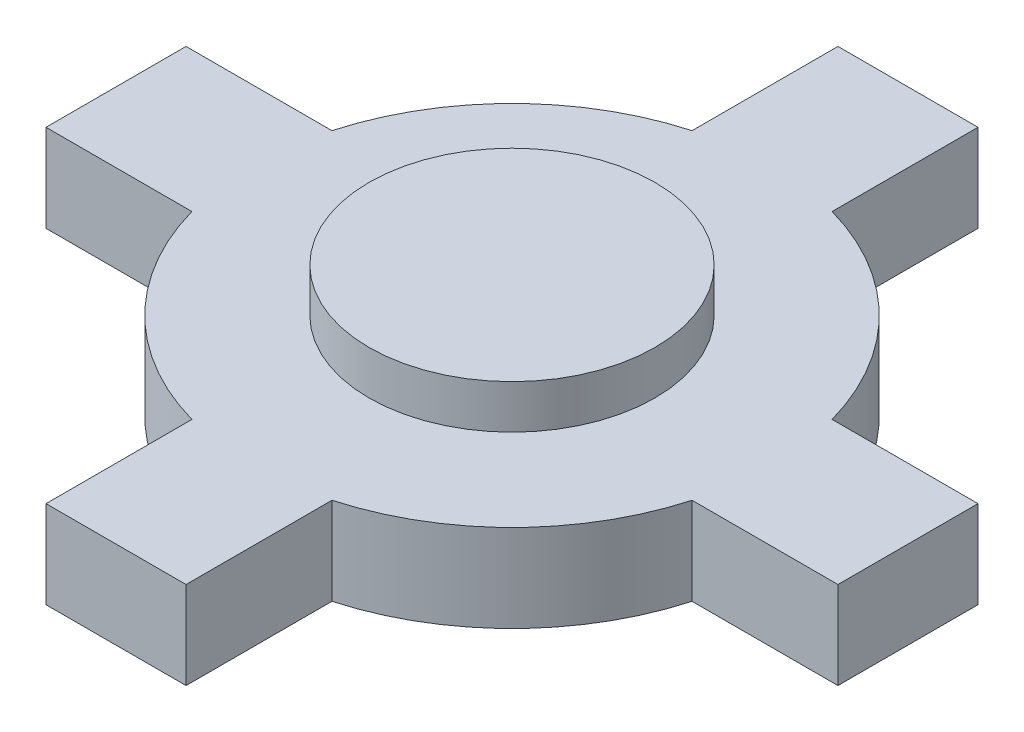
ISO-10303-21;
HEADER;
FILE_DESCRIPTION(('STEP AP214'),'2;1');
FILE_NAME('part.step','',(''),(''),'','','');
FILE_SCHEMA(('AUTOMOTIVE_DESIGN { 1 0 10303 214 1 1 1 1 }'));
ENDSEC;
DATA;
#1=APPLICATION_CONTEXT('core data for automotive mechanical design processes');
#2=APPLICATION_PROTOCOL_DEFINITION('international standard','automotive_design',2000,#1);
#3=PRODUCT_CONTEXT('',#1,'mechanical');
#4=PRODUCT('Part','Part','',(#3));
#5=PRODUCT_RELATED_PRODUCT_CATEGORY('part','',(#4));
#6=PRODUCT_DEFINITION_FORMATION('','',#4);
#7=PRODUCT_DEFINITION_CONTEXT('part definition',#1,'design');
#8=PRODUCT_DEFINITION('design','',#6,#7);
#9=PRODUCT_DEFINITION_SHAPE('','',#8);
#10=(LENGTH_UNIT() NAMED_UNIT(*) SI_UNIT(.MILLI.,.METRE.));
#11=(NAMED_UNIT(*) PLANE_ANGLE_UNIT() SI_UNIT($,.RADIAN.));
#12=(NAMED_UNIT(*) SI_UNIT($,.STERADIAN.) SOLID_ANGLE_UNIT());
#13=UNCERTAINTY_MEASURE_WITH_UNIT(LENGTH_MEASURE(1.E-05),#10,'distance_accuracy_value','');
#14=(GEOMETRIC_REPRESENTATION_CONTEXT(3) GLOBAL_UNCERTAINTY_ASSIGNED_CONTEXT((#13)) GLOBAL_UNIT_ASSIGNED_CONTEXT((#10,
#11,#12)) REPRESENTATION_CONTEXT('',''));
#15=CARTESIAN_POINT('',(0.,0.,0.));
#16=DIRECTION('',(0.,0.,1.));
#17=DIRECTION('',(1.,0.,0.));
#18=AXIS2_PLACEMENT_3D('',#15,#16,#17);
#19=CARTESIAN_POINT('',(-13.5702975444263,3.,-2.4));
#20=DIRECTION('',(1.,0.,0.));
#21=DIRECTION('',(0.,0.,-1.));
#22=AXIS2_PLACEMENT_3D('',#19,#20,#21);
#23=PLANE('',#22);
#24=DIRECTION('',(0.,0.,1.));
#25=VECTOR('',#24,1.);
#26=CARTESIAN_POINT('',(-13.5702975444263,0.,-2.4));
#27=LINE('',#26,#25);
#28=CARTESIAN_POINT('',(-13.5702975444263,0.,-2.4));
#29=VERTEX_POINT('',#28);
#30=CARTESIAN_POINT('',(-13.5702975444263,0.,2.4));
#31=VERTEX_POINT('',#30);
#32=EDGE_CURVE('E185',#29,#31,#27,.T.);
#33=ORIENTED_EDGE('',*,*,#32,.T.);
#34=DIRECTION('',(0.,-1.,0.));
#35=VECTOR('',#34,1.);
#36=CARTESIAN_POINT('',(-13.5702975444263,3.,2.4));
#37=LINE('',#36,#35);
#38=CARTESIAN_POINT('',(-13.5702975444263,3.,2.4));
#39=VERTEX_POINT('',#38);
#40=EDGE_CURVE('E42',#39,#31,#37,.T.);
#41=ORIENTED_EDGE('',*,*,#40,.F.);
#42=DIRECTION('',(0.,0.,1.));
#43=VECTOR('',#42,1.);
#44=CARTESIAN_POINT('',(-13.5702975444263,3.,-2.4));
#45=LINE('',#44,#43);
#46=CARTESIAN_POINT('',(-13.5702975444263,3.,-2.4));
#47=VERTEX_POINT('',#46);
#48=EDGE_CURVE('E216',#47,#39,#45,.T.);
#49=ORIENTED_EDGE('',*,*,#48,.F.);
#50=DIRECTION('',(0.,-1.,0.));
#51=VECTOR('',#50,1.);
#52=CARTESIAN_POINT('',(-13.5702975444263,3.,-2.4));
#53=LINE('',#52,#51);
#54=EDGE_CURVE('E181',#47,#29,#53,.T.);
#55=ORIENTED_EDGE('',*,*,#54,.T.);
#56=EDGE_LOOP('',(#33,#41,#49,#55));
#57=FACE_BOUND('',#56,.T.);
#58=ADVANCED_FACE('F39',(#57),#23,.F.);
#59=CARTESIAN_POINT('',(-13.5702975444263,3.,2.4));
#60=DIRECTION('',(0.,0.,-1.));
#61=DIRECTION('',(-1.,0.,0.));
#62=AXIS2_PLACEMENT_3D('',#59,#60,#61);
#63=PLANE('',#62);
#64=DIRECTION('',(1.,0.,0.));
#65=VECTOR('',#64,1.);
#66=CARTESIAN_POINT('',(-13.5702975444263,0.,2.4));
#67=LINE('',#66,#65);
#68=CARTESIAN_POINT('',(-8.57029754442633,0.,2.4));
#69=VERTEX_POINT('',#68);
#70=EDGE_CURVE('E188',#31,#69,#67,.T.);
#71=ORIENTED_EDGE('',*,*,#70,.T.);
#72=DIRECTION('',(0.,-1.,0.));
#73=VECTOR('',#72,1.);
#74=CARTESIAN_POINT('',(-8.57029754442633,3.,2.4));
#75=LINE('',#74,#73);
#76=CARTESIAN_POINT('',(-8.57029754442633,3.,2.4));
#77=VERTEX_POINT('',#76);
#78=EDGE_CURVE('E249',#77,#69,#75,.T.);
#79=ORIENTED_EDGE('',*,*,#78,.F.);
#80=DIRECTION('',(1.,0.,0.));
#81=VECTOR('',#80,1.);
#82=CARTESIAN_POINT('',(-13.5702975444263,3.,2.4));
#83=LINE('',#82,#81);
#84=EDGE_CURVE('E124',#39,#77,#83,.T.);
#85=ORIENTED_EDGE('',*,*,#84,.F.);
#86=ORIENTED_EDGE('',*,*,#40,.T.);
#87=EDGE_LOOP('',(#71,#79,#85,#86));
#88=FACE_BOUND('',#87,.T.);
#89=ADVANCED_FACE('F255',(#88),#63,.F.);
#90=CARTESIAN_POINT('',(0.,3.,0.));
#91=DIRECTION('',(0.,-1.,0.));
#92=DIRECTION('',(0.,0.,-1.));
#93=AXIS2_PLACEMENT_3D('',#90,#91,#92);
#94=CYLINDRICAL_SURFACE('',#93,8.9);
#95=CARTESIAN_POINT('',(0.,0.,0.));
#96=DIRECTION('',(0.,1.,0.));
#97=DIRECTION('',(0.,0.,1.));
#98=AXIS2_PLACEMENT_3D('',#95,#96,#97);
#99=CIRCLE('',#98,8.9);
#100=CARTESIAN_POINT('',(-2.39999999999999,0.,8.57029754442633));
#101=VERTEX_POINT('',#100);
#102=EDGE_CURVE('E191',#69,#101,#99,.T.);
#103=ORIENTED_EDGE('',*,*,#102,.T.);
#104=DIRECTION('',(0.,-1.,0.));
#105=VECTOR('',#104,1.);
#106=CARTESIAN_POINT('',(-2.39999999999999,3.,8.57029754442633));
#107=LINE('',#106,#105);
#108=CARTESIAN_POINT('',(-2.39999999999999,3.,8.57029754442633));
#109=VERTEX_POINT('',#108);
#110=EDGE_CURVE('E247',#109,#101,#107,.T.);
#111=ORIENTED_EDGE('',*,*,#110,.F.);
#112=CARTESIAN_POINT('',(0.,3.,0.));
#113=DIRECTION('',(0.,1.,0.));
#114=DIRECTION('',(0.,0.,1.));
#115=AXIS2_PLACEMENT_3D('',#112,#113,#114);
#116=CIRCLE('',#115,8.9);
#117=EDGE_CURVE('E272',#77,#109,#116,.T.);
#118=ORIENTED_EDGE('',*,*,#117,.F.);
#119=ORIENTED_EDGE('',*,*,#78,.T.);
#120=EDGE_LOOP('',(#103,#111,#118,#119));
#121=FACE_BOUND('',#120,.T.);
#122=ADVANCED_FACE('F264',(#121),#94,.T.);
#123=CARTESIAN_POINT('',(-2.39999999999999,3.,8.57029754442633));
#124=DIRECTION('',(1.,0.,0.));
#125=DIRECTION('',(0.,0.,-1.));
#126=AXIS2_PLACEMENT_3D('',#123,#124,#125);
#127=PLANE('',#126);
#128=DIRECTION('',(0.,0.,1.));
#129=VECTOR('',#128,1.);
#130=CARTESIAN_POINT('',(-2.39999999999999,0.,8.57029754442633));
#131=LINE('',#130,#129);
#132=CARTESIAN_POINT('',(-2.4,0.,13.5702975444263));
#133=VERTEX_POINT('',#132);
#134=EDGE_CURVE('E193',#101,#133,#131,.T.);
#135=ORIENTED_EDGE('',*,*,#134,.T.);
#136=DIRECTION('',(0.,-1.,0.));
#137=VECTOR('',#136,1.);
#138=CARTESIAN_POINT('',(-2.4,3.,13.5702975444263));
#139=LINE('',#138,#137);
#140=CARTESIAN_POINT('',(-2.4,3.,13.5702975444263));
#141=VERTEX_POINT('',#140);
#142=EDGE_CURVE('E244',#141,#133,#139,.T.);
#143=ORIENTED_EDGE('',*,*,#142,.F.);
#144=DIRECTION('',(0.,0.,1.));
#145=VECTOR('',#144,1.);
#146=CARTESIAN_POINT('',(-2.39999999999999,3.,8.57029754442633));
#147=LINE('',#146,#145);
#148=EDGE_CURVE('E269',#109,#141,#147,.T.);
#149=ORIENTED_EDGE('',*,*,#148,.F.);
#150=ORIENTED_EDGE('',*,*,#110,.T.);
#151=EDGE_LOOP('',(#135,#143,#149,#150));
#152=FACE_BOUND('',#151,.T.);
#153=ADVANCED_FACE('F267',(#152),#127,.F.);
#154=CARTESIAN_POINT('',(-2.4,3.,13.5702975444263));
#155=DIRECTION('',(0.,0.,-1.));
#156=DIRECTION('',(-1.,0.,0.));
#157=AXIS2_PLACEMENT_3D('',#154,#155,#156);
#158=PLANE('',#157);
#159=DIRECTION('',(1.,0.,0.));
#160=VECTOR('',#159,1.);
#161=CARTESIAN_POINT('',(-2.4,0.,13.5702975444263));
#162=LINE('',#161,#160);
#163=CARTESIAN_POINT('',(2.4,0.,13.5702975444263));
#164=VERTEX_POINT('',#163);
#165=EDGE_CURVE('E195',#133,#164,#162,.T.);
#166=ORIENTED_EDGE('',*,*,#165,.T.);
#167=DIRECTION('',(0.,-1.,0.));
#168=VECTOR('',#167,1.);
#169=CARTESIAN_POINT('',(2.4,3.,13.5702975444263));
#170=LINE('',#169,#168);
#171=CARTESIAN_POINT('',(2.4,3.,13.5702975444263));
#172=VERTEX_POINT('',#171);
#173=EDGE_CURVE('E241',#172,#164,#170,.T.);
#174=ORIENTED_EDGE('',*,*,#173,.F.);
#175=DIRECTION('',(1.,0.,0.));
#176=VECTOR('',#175,1.);
#177=CARTESIAN_POINT('',(-2.4,3.,13.5702975444263));
#178=LINE('',#177,#176);
#179=EDGE_CURVE('E271',#141,#172,#178,.T.);
#180=ORIENTED_EDGE('',*,*,#179,.F.);
#181=ORIENTED_EDGE('',*,*,#142,.T.);
#182=EDGE_LOOP('',(#166,#174,#180,#181));
#183=FACE_BOUND('',#182,.T.);
#184=ADVANCED_FACE('F331',(#183),#158,.F.);
#185=CARTESIAN_POINT('',(2.39999999999999,3.,8.57029754442633));
#186=DIRECTION('',(-1.,0.,0.));
#187=DIRECTION('',(0.,0.,1.));
#188=AXIS2_PLACEMENT_3D('',#185,#186,#187);
#189=PLANE('',#188);
#190=DIRECTION('',(0.,0.,-1.));
#191=VECTOR('',#190,1.);
#192=CARTESIAN_POINT('',(2.39999999999999,0.,8.57029754442633));
#193=LINE('',#192,#191);
#194=CARTESIAN_POINT('',(2.39999999999999,0.,8.57029754442633));
#195=VERTEX_POINT('',#194);
#196=EDGE_CURVE('E197',#164,#195,#193,.T.);
#197=ORIENTED_EDGE('',*,*,#196,.T.);
#198=DIRECTION('',(0.,-1.,0.));
#199=VECTOR('',#198,1.);
#200=CARTESIAN_POINT('',(2.39999999999999,3.,8.57029754442633));
#201=LINE('',#200,#199);
#202=CARTESIAN_POINT('',(2.39999999999999,3.,8.57029754442633));
#203=VERTEX_POINT('',#202);
#204=EDGE_CURVE('E238',#203,#195,#201,.T.);
#205=ORIENTED_EDGE('',*,*,#204,.F.);
#206=DIRECTION('',(0.,0.,-1.));
#207=VECTOR('',#206,1.);
#208=CARTESIAN_POINT('',(2.39999999999999,3.,8.57029754442633));
#209=LINE('',#208,#207);
#210=EDGE_CURVE('E274',#172,#203,#209,.T.);
#211=ORIENTED_EDGE('',*,*,#210,.F.);
#212=ORIENTED_EDGE('',*,*,#173,.T.);
#213=EDGE_LOOP('',(#197,#205,#211,#212));
#214=FACE_BOUND('',#213,.T.);
#215=ADVANCED_FACE('F328',(#214),#189,.F.);
#216=CARTESIAN_POINT('',(0.,3.,0.));
#217=DIRECTION('',(0.,-1.,0.));
#218=DIRECTION('',(0.,0.,-1.));
#219=AXIS2_PLACEMENT_3D('',#216,#217,#218);
#220=CYLINDRICAL_SURFACE('',#219,8.9);
#221=CARTESIAN_POINT('',(0.,0.,0.));
#222=DIRECTION('',(0.,1.,0.));
#223=DIRECTION('',(0.,0.,1.));
#224=AXIS2_PLACEMENT_3D('',#221,#222,#223);
#225=CIRCLE('',#224,8.9);
#226=CARTESIAN_POINT('',(8.57029754442633,0.,2.4));
#227=VERTEX_POINT('',#226);
#228=EDGE_CURVE('E199',#195,#227,#225,.T.);
#229=ORIENTED_EDGE('',*,*,#228,.T.);
#230=DIRECTION('',(0.,-1.,0.));
#231=VECTOR('',#230,1.);
#232=CARTESIAN_POINT('',(8.57029754442633,3.,2.4));
#233=LINE('',#232,#231);
#234=CARTESIAN_POINT('',(8.57029754442633,3.,2.4));
#235=VERTEX_POINT('',#234);
#236=EDGE_CURVE('E235',#235,#227,#233,.T.);
#237=ORIENTED_EDGE('',*,*,#236,.F.);
#238=CARTESIAN_POINT('',(0.,3.,0.));
#239=DIRECTION('',(0.,1.,0.));
#240=DIRECTION('',(0.,0.,1.));
#241=AXIS2_PLACEMENT_3D('',#238,#239,#240);
#242=CIRCLE('',#241,8.9);
#243=EDGE_CURVE('E280',#203,#235,#242,.T.);
#244=ORIENTED_EDGE('',*,*,#243,.F.);
#245=ORIENTED_EDGE('',*,*,#204,.T.);
#246=EDGE_LOOP('',(#229,#237,#244,#245));
#247=FACE_BOUND('',#246,.T.);
#248=ADVANCED_FACE('F324',(#247),#220,.T.);
#249=CARTESIAN_POINT('',(8.57029754442633,3.,2.4));
#250=DIRECTION('',(0.,0.,-1.));
#251=DIRECTION('',(-1.,0.,0.));
#252=AXIS2_PLACEMENT_3D('',#249,#250,#251);
#253=PLANE('',#252);
#254=DIRECTION('',(1.,0.,0.));
#255=VECTOR('',#254,1.);
#256=CARTESIAN_POINT('',(8.57029754442633,0.,2.4));
#257=LINE('',#256,#255);
#258=CARTESIAN_POINT('',(13.5702975444263,0.,2.4));
#259=VERTEX_POINT('',#258);
#260=EDGE_CURVE('E201',#227,#259,#257,.T.);
#261=ORIENTED_EDGE('',*,*,#260,.T.);
#262=DIRECTION('',(0.,-1.,0.));
#263=VECTOR('',#262,1.);
#264=CARTESIAN_POINT('',(13.5702975444263,3.,2.4));
#265=LINE('',#264,#263);
#266=CARTESIAN_POINT('',(13.5702975444263,3.,2.4));
#267=VERTEX_POINT('',#266);
#268=EDGE_CURVE('E232',#267,#259,#265,.T.);
#269=ORIENTED_EDGE('',*,*,#268,.F.);
#270=DIRECTION('',(1.,0.,0.));
#271=VECTOR('',#270,1.);
#272=CARTESIAN_POINT('',(8.57029754442633,3.,2.4));
#273=LINE('',#272,#271);
#274=EDGE_CURVE('E282',#235,#267,#273,.T.);
#275=ORIENTED_EDGE('',*,*,#274,.F.);
#276=ORIENTED_EDGE('',*,*,#236,.T.);
#277=EDGE_LOOP('',(#261,#269,#275,#276));
#278=FACE_BOUND('',#277,.T.);
#279=ADVANCED_FACE('F319',(#278),#253,.F.);
#280=CARTESIAN_POINT('',(13.5702975444263,3.,-2.4));
#281=DIRECTION('',(-1.,0.,0.));
#282=DIRECTION('',(0.,0.,1.));
#283=AXIS2_PLACEMENT_3D('',#280,#281,#282);
#284=PLANE('',#283);
#285=DIRECTION('',(0.,0.,-1.));
#286=VECTOR('',#285,1.);
#287=CARTESIAN_POINT('',(13.5702975444263,0.,-2.4));
#288=LINE('',#287,#286);
#289=CARTESIAN_POINT('',(13.5702975444263,0.,-2.4));
#290=VERTEX_POINT('',#289);
#291=EDGE_CURVE('E203',#259,#290,#288,.T.);
#292=ORIENTED_EDGE('',*,*,#291,.T.);
#293=DIRECTION('',(0.,-1.,0.));
#294=VECTOR('',#293,1.);
#295=CARTESIAN_POINT('',(13.5702975444263,3.,-2.4));
#296=LINE('',#295,#294);
#297=CARTESIAN_POINT('',(13.5702975444263,3.,-2.4));
#298=VERTEX_POINT('',#297);
#299=EDGE_CURVE('E229',#298,#290,#296,.T.);
#300=ORIENTED_EDGE('',*,*,#299,.F.);
#301=DIRECTION('',(0.,0.,-1.));
#302=VECTOR('',#301,1.);
#303=CARTESIAN_POINT('',(13.5702975444263,3.,-2.4));
#304=LINE('',#303,#302);
#305=EDGE_CURVE('E284',#267,#298,#304,.T.);
#306=ORIENTED_EDGE('',*,*,#305,.F.);
#307=ORIENTED_EDGE('',*,*,#268,.T.);
#308=EDGE_LOOP('',(#292,#300,#306,#307));
#309=FACE_BOUND('',#308,.T.);
#310=ADVANCED_FACE('F313',(#309),#284,.F.);
#311=CARTESIAN_POINT('',(8.57029754442633,3.,-2.4));
#312=DIRECTION('',(0.,0.,1.));
#313=DIRECTION('',(1.,0.,0.));
#314=AXIS2_PLACEMENT_3D('',#311,#312,#313);
#315=PLANE('',#314);
#316=DIRECTION('',(-1.,0.,0.));
#317=VECTOR('',#316,1.);
#318=CARTESIAN_POINT('',(8.57029754442633,0.,-2.4));
#319=LINE('',#318,#317);
#320=CARTESIAN_POINT('',(8.57029754442633,0.,-2.4));
#321=VERTEX_POINT('',#320);
#322=EDGE_CURVE('E205',#290,#321,#319,.T.);
#323=ORIENTED_EDGE('',*,*,#322,.T.);
#324=DIRECTION('',(0.,-1.,0.));
#325=VECTOR('',#324,1.);
#326=CARTESIAN_POINT('',(8.57029754442633,3.,-2.4));
#327=LINE('',#326,#325);
#328=CARTESIAN_POINT('',(8.57029754442633,3.,-2.4));
#329=VERTEX_POINT('',#328);
#330=EDGE_CURVE('E226',#329,#321,#327,.T.);
#331=ORIENTED_EDGE('',*,*,#330,.F.);
#332=DIRECTION('',(-1.,0.,0.));
#333=VECTOR('',#332,1.);
#334=CARTESIAN_POINT('',(8.57029754442633,3.,-2.4));
#335=LINE('',#334,#333);
#336=EDGE_CURVE('E286',#298,#329,#335,.T.);
#337=ORIENTED_EDGE('',*,*,#336,.F.);
#338=ORIENTED_EDGE('',*,*,#299,.T.);
#339=EDGE_LOOP('',(#323,#331,#337,#338));
#340=FACE_BOUND('',#339,.T.);
#341=ADVANCED_FACE('F309',(#340),#315,.F.);
#342=CARTESIAN_POINT('',(0.,3.,0.));
#343=DIRECTION('',(0.,-1.,0.));
#344=DIRECTION('',(0.,0.,-1.));
#345=AXIS2_PLACEMENT_3D('',#342,#343,#344);
#346=CYLINDRICAL_SURFACE('',#345,8.9);
#347=CARTESIAN_POINT('',(0.,0.,0.));
#348=DIRECTION('',(0.,1.,0.));
#349=DIRECTION('',(0.,0.,1.));
#350=AXIS2_PLACEMENT_3D('',#347,#348,#349);
#351=CIRCLE('',#350,8.9);
#352=CARTESIAN_POINT('',(2.4,0.,-8.57029754442633));
#353=VERTEX_POINT('',#352);
#354=EDGE_CURVE('E207',#321,#353,#351,.T.);
#355=ORIENTED_EDGE('',*,*,#354,.T.);
#356=DIRECTION('',(0.,-1.,0.));
#357=VECTOR('',#356,1.);
#358=CARTESIAN_POINT('',(2.4,3.,-8.57029754442633));
#359=LINE('',#358,#357);
#360=CARTESIAN_POINT('',(2.4,3.,-8.57029754442633));
#361=VERTEX_POINT('',#360);
#362=EDGE_CURVE('E223',#361,#353,#359,.T.);
#363=ORIENTED_EDGE('',*,*,#362,.F.);
#364=CARTESIAN_POINT('',(0.,3.,0.));
#365=DIRECTION('',(0.,1.,0.));
#366=DIRECTION('',(0.,0.,1.));
#367=AXIS2_PLACEMENT_3D('',#364,#365,#366);
#368=CIRCLE('',#367,8.9);
#369=EDGE_CURVE('E288',#329,#361,#368,.T.);
#370=ORIENTED_EDGE('',*,*,#369,.F.);
#371=ORIENTED_EDGE('',*,*,#330,.T.);
#372=EDGE_LOOP('',(#355,#363,#370,#371));
#373=FACE_BOUND('',#372,.T.);
#374=ADVANCED_FACE('F305',(#373),#346,.T.);
#375=CARTESIAN_POINT('',(2.4,3.,-13.5702975444263));
#376=DIRECTION('',(-1.,0.,0.));
#377=DIRECTION('',(0.,0.,1.));
#378=AXIS2_PLACEMENT_3D('',#375,#376,#377);
#379=PLANE('',#378);
#380=DIRECTION('',(0.,0.,-1.));
#381=VECTOR('',#380,1.);
#382=CARTESIAN_POINT('',(2.4,0.,-13.5702975444263));
#383=LINE('',#382,#381);
#384=CARTESIAN_POINT('',(2.4,0.,-13.5702975444263));
#385=VERTEX_POINT('',#384);
#386=EDGE_CURVE('E209',#353,#385,#383,.T.);
#387=ORIENTED_EDGE('',*,*,#386,.T.);
#388=DIRECTION('',(0.,-1.,0.));
#389=VECTOR('',#388,1.);
#390=CARTESIAN_POINT('',(2.4,3.,-13.5702975444263));
#391=LINE('',#390,#389);
#392=CARTESIAN_POINT('',(2.4,3.,-13.5702975444263));
#393=VERTEX_POINT('',#392);
#394=EDGE_CURVE('E220',#393,#385,#391,.T.);
#395=ORIENTED_EDGE('',*,*,#394,.F.);
#396=DIRECTION('',(0.,0.,-1.));
#397=VECTOR('',#396,1.);
#398=CARTESIAN_POINT('',(2.4,3.,-13.5702975444263));
#399=LINE('',#398,#397);
#400=EDGE_CURVE('E290',#361,#393,#399,.T.);
#401=ORIENTED_EDGE('',*,*,#400,.F.);
#402=ORIENTED_EDGE('',*,*,#362,.T.);
#403=EDGE_LOOP('',(#387,#395,#401,#402));
#404=FACE_BOUND('',#403,.T.);
#405=ADVANCED_FACE('F296',(#404),#379,.F.);
#406=CARTESIAN_POINT('',(-2.4,3.,-13.5702975444263));
#407=DIRECTION('',(0.,0.,1.));
#408=DIRECTION('',(1.,0.,0.));
#409=AXIS2_PLACEMENT_3D('',#406,#407,#408);
#410=PLANE('',#409);
#411=DIRECTION('',(-1.,0.,0.));
#412=VECTOR('',#411,1.);
#413=CARTESIAN_POINT('',(-2.4,0.,-13.5702975444263));
#414=LINE('',#413,#412);
#415=CARTESIAN_POINT('',(-2.4,0.,-13.5702975444263));
#416=VERTEX_POINT('',#415);
#417=EDGE_CURVE('E211',#385,#416,#414,.T.);
#418=ORIENTED_EDGE('',*,*,#417,.T.);
#419=DIRECTION('',(0.,-1.,0.));
#420=VECTOR('',#419,1.);
#421=CARTESIAN_POINT('',(-2.4,3.,-13.5702975444263));
#422=LINE('',#421,#420);
#423=CARTESIAN_POINT('',(-2.4,3.,-13.5702975444263));
#424=VERTEX_POINT('',#423);
#425=EDGE_CURVE('E176',#424,#416,#422,.T.);
#426=ORIENTED_EDGE('',*,*,#425,.F.);
#427=DIRECTION('',(-1.,0.,0.));
#428=VECTOR('',#427,1.);
#429=CARTESIAN_POINT('',(-2.4,3.,-13.5702975444263));
#430=LINE('',#429,#428);
#431=EDGE_CURVE('E167',#393,#424,#430,.T.);
#432=ORIENTED_EDGE('',*,*,#431,.F.);
#433=ORIENTED_EDGE('',*,*,#394,.T.);
#434=EDGE_LOOP('',(#418,#426,#432,#433));
#435=FACE_BOUND('',#434,.T.);
#436=ADVANCED_FACE('F300',(#435),#410,.F.);
#437=CARTESIAN_POINT('',(-2.4,3.,-13.5702975444263));
#438=DIRECTION('',(1.,0.,0.));
#439=DIRECTION('',(0.,0.,-1.));
#440=AXIS2_PLACEMENT_3D('',#437,#438,#439);
#441=PLANE('',#440);
#442=DIRECTION('',(0.,0.,1.));
#443=VECTOR('',#442,1.);
#444=CARTESIAN_POINT('',(-2.4,0.,-13.5702975444263));
#445=LINE('',#444,#443);
#446=CARTESIAN_POINT('',(-2.4,0.,-8.57029754442633));
#447=VERTEX_POINT('',#446);
#448=EDGE_CURVE('E175',#416,#447,#445,.T.);
#449=ORIENTED_EDGE('',*,*,#448,.T.);
#450=DIRECTION('',(0.,-1.,0.));
#451=VECTOR('',#450,1.);
#452=CARTESIAN_POINT('',(-2.4,3.,-8.57029754442633));
#453=LINE('',#452,#451);
#454=CARTESIAN_POINT('',(-2.4,3.,-8.57029754442633));
#455=VERTEX_POINT('',#454);
#456=EDGE_CURVE('E172',#455,#447,#453,.T.);
#457=ORIENTED_EDGE('',*,*,#456,.F.);
#458=DIRECTION('',(0.,0.,1.));
#459=VECTOR('',#458,1.);
#460=CARTESIAN_POINT('',(-2.4,3.,-13.5702975444263));
#461=LINE('',#460,#459);
#462=EDGE_CURVE('E161',#424,#455,#461,.T.);
#463=ORIENTED_EDGE('',*,*,#462,.F.);
#464=ORIENTED_EDGE('',*,*,#425,.T.);
#465=EDGE_LOOP('',(#449,#457,#463,#464));
#466=FACE_BOUND('',#465,.T.);
#467=ADVANCED_FACE('F173',(#466),#441,.F.);
#468=CARTESIAN_POINT('',(0.,3.,0.));
#469=DIRECTION('',(0.,-1.,0.));
#470=DIRECTION('',(0.,0.,-1.));
#471=AXIS2_PLACEMENT_3D('',#468,#469,#470);
#472=CYLINDRICAL_SURFACE('',#471,8.9);
#473=CARTESIAN_POINT('',(0.,0.,0.));
#474=DIRECTION('',(0.,1.,0.));
#475=DIRECTION('',(0.,0.,1.));
#476=AXIS2_PLACEMENT_3D('',#473,#474,#475);
#477=CIRCLE('',#476,8.9);
#478=CARTESIAN_POINT('',(-8.57029754442633,0.,-2.4));
#479=VERTEX_POINT('',#478);
#480=EDGE_CURVE('E109',#447,#479,#477,.T.);
#481=ORIENTED_EDGE('',*,*,#480,.T.);
#482=DIRECTION('',(0.,-1.,0.));
#483=VECTOR('',#482,1.);
#484=CARTESIAN_POINT('',(-8.57029754442633,3.,-2.4));
#485=LINE('',#484,#483);
#486=CARTESIAN_POINT('',(-8.57029754442633,3.,-2.4));
#487=VERTEX_POINT('',#486);
#488=EDGE_CURVE('E177',#487,#479,#485,.T.);
#489=ORIENTED_EDGE('',*,*,#488,.F.);
#490=CARTESIAN_POINT('',(0.,3.,0.));
#491=DIRECTION('',(0.,1.,0.));
#492=DIRECTION('',(0.,0.,1.));
#493=AXIS2_PLACEMENT_3D('',#490,#491,#492);
#494=CIRCLE('',#493,8.9);
#495=EDGE_CURVE('E165',#455,#487,#494,.T.);
#496=ORIENTED_EDGE('',*,*,#495,.F.);
#497=ORIENTED_EDGE('',*,*,#456,.T.);
#498=EDGE_LOOP('',(#481,#489,#496,#497));
#499=FACE_BOUND('',#498,.T.);
#500=ADVANCED_FACE('F179',(#499),#472,.T.);
#501=CARTESIAN_POINT('',(-13.5702975444263,3.,-2.4));
#502=DIRECTION('',(0.,0.,1.));
#503=DIRECTION('',(1.,0.,0.));
#504=AXIS2_PLACEMENT_3D('',#501,#502,#503);
#505=PLANE('',#504);
#506=DIRECTION('',(-1.,0.,0.));
#507=VECTOR('',#506,1.);
#508=CARTESIAN_POINT('',(-13.5702975444263,0.,-2.4));
#509=LINE('',#508,#507);
#510=EDGE_CURVE('E115',#479,#29,#509,.T.);
#511=ORIENTED_EDGE('',*,*,#510,.T.);
#512=ORIENTED_EDGE('',*,*,#54,.F.);
#513=DIRECTION('',(-1.,0.,0.));
#514=VECTOR('',#513,1.);
#515=CARTESIAN_POINT('',(-13.5702975444263,3.,-2.4));
#516=LINE('',#515,#514);
#517=EDGE_CURVE('E56',#487,#47,#516,.T.);
#518=ORIENTED_EDGE('',*,*,#517,.F.);
#519=ORIENTED_EDGE('',*,*,#488,.T.);
#520=EDGE_LOOP('',(#511,#512,#518,#519));
#521=FACE_BOUND('',#520,.T.);
#522=ADVANCED_FACE('F415',(#521),#505,.F.);
#523=CARTESIAN_POINT('',(0.,3.,0.));
#524=DIRECTION('',(0.,1.,0.));
#525=DIRECTION('',(0.,0.,1.));
#526=AXIS2_PLACEMENT_3D('',#523,#524,#525);
#527=PLANE('',#526);
#528=CARTESIAN_POINT('',(0.,3.,0.));
#529=DIRECTION('',(0.,1.,0.));
#530=DIRECTION('',(0.,0.,1.));
#531=AXIS2_PLACEMENT_3D('',#528,#529,#530);
#532=CIRCLE('',#531,4.9);
#533=CARTESIAN_POINT('',(0.,3.,4.9));
#534=VERTEX_POINT('',#533);
#535=EDGE_CURVE('E11',#534,#534,#532,.T.);
#536=ORIENTED_EDGE('',*,*,#535,.F.);
#537=EDGE_LOOP('',(#536));
#538=FACE_BOUND('',#537,.T.);
#539=ORIENTED_EDGE('',*,*,#48,.T.);
#540=ORIENTED_EDGE('',*,*,#84,.T.);
#541=ORIENTED_EDGE('',*,*,#117,.T.);
#542=ORIENTED_EDGE('',*,*,#148,.T.);
#543=ORIENTED_EDGE('',*,*,#179,.T.);
#544=ORIENTED_EDGE('',*,*,#210,.T.);
#545=ORIENTED_EDGE('',*,*,#243,.T.);
#546=ORIENTED_EDGE('',*,*,#274,.T.);
#547=ORIENTED_EDGE('',*,*,#305,.T.);
#548=ORIENTED_EDGE('',*,*,#336,.T.);
#549=ORIENTED_EDGE('',*,*,#369,.T.);
#550=ORIENTED_EDGE('',*,*,#400,.T.);
#551=ORIENTED_EDGE('',*,*,#431,.T.);
#552=ORIENTED_EDGE('',*,*,#462,.T.);
#553=ORIENTED_EDGE('',*,*,#495,.T.);
#554=ORIENTED_EDGE('',*,*,#517,.T.);
#555=EDGE_LOOP('',(#539,#540,#541,#542,#543,#544,#545,#546,#547,#548,#549,#550,#551,#552,#553,#554));
#556=FACE_BOUND('',#555,.T.);
#557=ADVANCED_FACE('F163',(#538,#556),#527,.T.);
#558=CARTESIAN_POINT('',(0.,0.,0.));
#559=DIRECTION('',(0.,1.,0.));
#560=DIRECTION('',(0.,0.,1.));
#561=AXIS2_PLACEMENT_3D('',#558,#559,#560);
#562=PLANE('',#561);
#563=ORIENTED_EDGE('',*,*,#32,.F.);
#564=ORIENTED_EDGE('',*,*,#510,.F.);
#565=ORIENTED_EDGE('',*,*,#480,.F.);
#566=ORIENTED_EDGE('',*,*,#448,.F.);
#567=ORIENTED_EDGE('',*,*,#417,.F.);
#568=ORIENTED_EDGE('',*,*,#386,.F.);
#569=ORIENTED_EDGE('',*,*,#354,.F.);
#570=ORIENTED_EDGE('',*,*,#322,.F.);
#571=ORIENTED_EDGE('',*,*,#291,.F.);
#572=ORIENTED_EDGE('',*,*,#260,.F.);
#573=ORIENTED_EDGE('',*,*,#228,.F.);
#574=ORIENTED_EDGE('',*,*,#196,.F.);
#575=ORIENTED_EDGE('',*,*,#165,.F.);
#576=ORIENTED_EDGE('',*,*,#134,.F.);
#577=ORIENTED_EDGE('',*,*,#102,.F.);
#578=ORIENTED_EDGE('',*,*,#70,.F.);
#579=EDGE_LOOP('',(#563,#564,#565,#566,#567,#568,#569,#570,#571,#572,#573,#574,#575,#576,#577,#578));
#580=FACE_BOUND('',#579,.T.);
#581=ADVANCED_FACE('F260',(#580),#562,.F.);
#582=CARTESIAN_POINT('',(0.,4.5,0.));
#583=DIRECTION('',(0.,-1.,0.));
#584=DIRECTION('',(0.,0.,-1.));
#585=AXIS2_PLACEMENT_3D('',#582,#583,#584);
#586=CYLINDRICAL_SURFACE('',#585,4.9);
#587=CARTESIAN_POINT('',(0.,4.5,0.));
#588=DIRECTION('',(0.,1.,0.));
#589=DIRECTION('',(0.,0.,1.));
#590=AXIS2_PLACEMENT_3D('',#587,#588,#589);
#591=CIRCLE('',#590,4.9);
#592=CARTESIAN_POINT('',(0.,4.5,4.9));
#593=VERTEX_POINT('',#592);
#594=EDGE_CURVE('E189',#593,#593,#591,.T.);
#595=ORIENTED_EDGE('',*,*,#594,.F.);
#596=EDGE_LOOP('',(#595));
#597=FACE_BOUND('',#596,.T.);
#598=ORIENTED_EDGE('',*,*,#535,.T.);
#599=EDGE_LOOP('',(#598));
#600=FACE_BOUND('',#599,.T.);
#601=ADVANCED_FACE('F436',(#597,#600),#586,.T.);
#602=CARTESIAN_POINT('',(0.,4.5,0.));
#603=DIRECTION('',(0.,1.,0.));
#604=DIRECTION('',(0.,0.,1.));
#605=AXIS2_PLACEMENT_3D('',#602,#603,#604);
#606=PLANE('',#605);
#607=ORIENTED_EDGE('',*,*,#594,.T.);
#608=EDGE_LOOP('',(#607));
#609=FACE_BOUND('',#608,.T.);
#610=ADVANCED_FACE('F442',(#609),#606,.T.);
#611=CLOSED_SHELL('',(#58,#89,#122,#153,#184,#215,#248,#279,#310,#341,#374,#405,#436,#467,#500,
#522,#557,#581,#601,#610));
#612=MANIFOLD_SOLID_BREP('B2',#611);
#613=ADVANCED_BREP_SHAPE_REPRESENTATION('',(#18,#612),#14);
#614=SHAPE_DEFINITION_REPRESENTATION(#9,#613);
ENDSEC;
END-ISO-10303-21;
